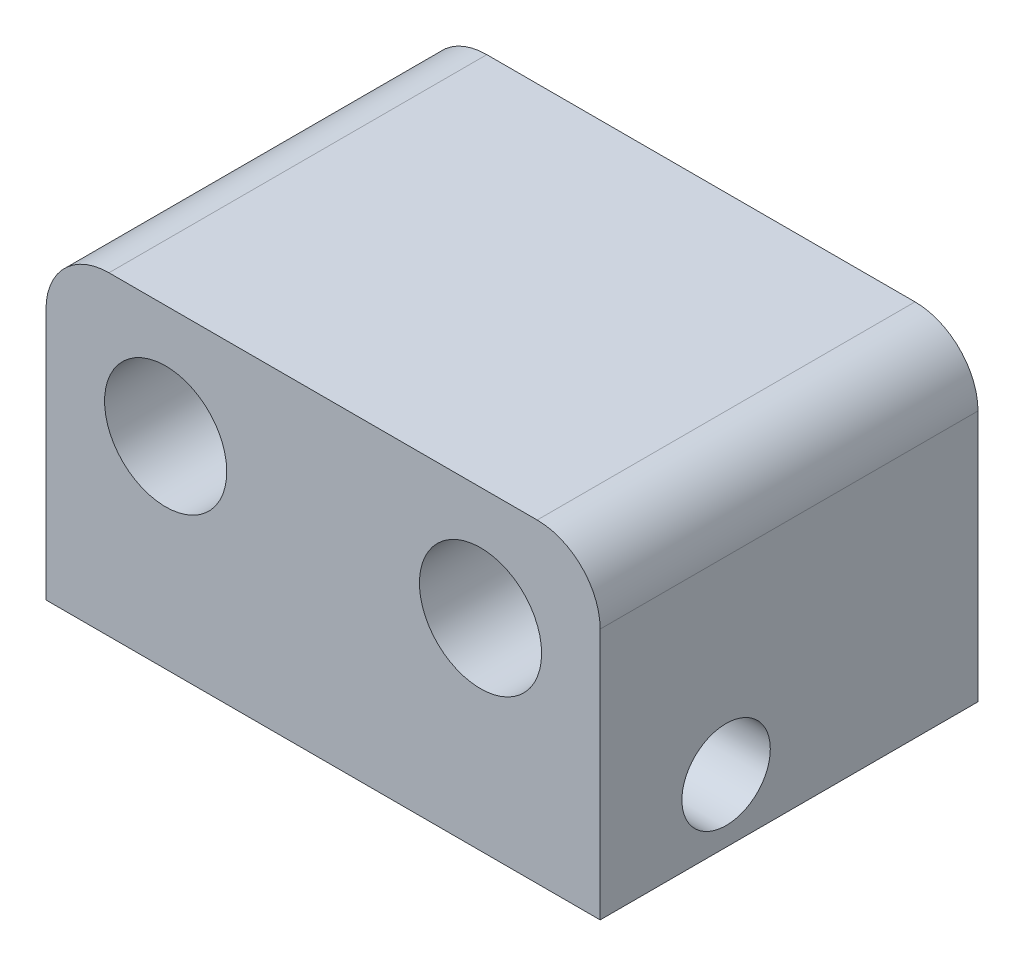
ISO-10303-21;
HEADER;
FILE_DESCRIPTION(('STEP AP214'),'2;1');
FILE_NAME('part.step','',(''),(''),'','','');
FILE_SCHEMA(('AUTOMOTIVE_DESIGN { 1 0 10303 214 1 1 1 1 }'));
ENDSEC;
DATA;
#1=APPLICATION_CONTEXT('core data for automotive mechanical design processes');
#2=APPLICATION_PROTOCOL_DEFINITION('international standard','automotive_design',2000,#1);
#3=PRODUCT_CONTEXT('',#1,'mechanical');
#4=PRODUCT('Part','Part','',(#3));
#5=PRODUCT_RELATED_PRODUCT_CATEGORY('part','',(#4));
#6=PRODUCT_DEFINITION_FORMATION('','',#4);
#7=PRODUCT_DEFINITION_CONTEXT('part definition',#1,'design');
#8=PRODUCT_DEFINITION('design','',#6,#7);
#9=PRODUCT_DEFINITION_SHAPE('','',#8);
#10=(LENGTH_UNIT() NAMED_UNIT(*) SI_UNIT(.MILLI.,.METRE.));
#11=(NAMED_UNIT(*) PLANE_ANGLE_UNIT() SI_UNIT($,.RADIAN.));
#12=(NAMED_UNIT(*) SI_UNIT($,.STERADIAN.) SOLID_ANGLE_UNIT());
#13=UNCERTAINTY_MEASURE_WITH_UNIT(LENGTH_MEASURE(1.E-05),#10,'distance_accuracy_value','');
#14=(GEOMETRIC_REPRESENTATION_CONTEXT(3) GLOBAL_UNCERTAINTY_ASSIGNED_CONTEXT((#13)) GLOBAL_UNIT_ASSIGNED_CONTEXT((#10,
#11,#12)) REPRESENTATION_CONTEXT('',''));
#15=CARTESIAN_POINT('',(0.,0.,0.));
#16=DIRECTION('',(0.,0.,1.));
#17=DIRECTION('',(1.,0.,0.));
#18=AXIS2_PLACEMENT_3D('',#15,#16,#17);
#19=CARTESIAN_POINT('',(-11.,0.,15.));
#20=DIRECTION('',(1.,0.,0.));
#21=DIRECTION('',(0.,0.,-1.));
#22=AXIS2_PLACEMENT_3D('',#19,#20,#21);
#23=PLANE('',#22);
#24=CARTESIAN_POINT('',(-11.,15.,10.));
#25=DIRECTION('',(1.,0.,0.));
#26=DIRECTION('',(0.,0.,-1.));
#27=AXIS2_PLACEMENT_3D('',#24,#25,#26);
#28=CIRCLE('',#27,1.755);
#29=CARTESIAN_POINT('',(-11.,15.,8.245));
#30=VERTEX_POINT('',#29);
#31=EDGE_CURVE('E161',#30,#30,#28,.T.);
#32=ORIENTED_EDGE('',*,*,#31,.T.);
#33=EDGE_LOOP('',(#32));
#34=FACE_BOUND('',#33,.T.);
#35=DIRECTION('',(0.,-1.,0.));
#36=VECTOR('',#35,1.);
#37=CARTESIAN_POINT('',(-11.,0.,15.));
#38=LINE('',#37,#36);
#39=CARTESIAN_POINT('',(-11.,22.5,15.));
#40=VERTEX_POINT('',#39);
#41=CARTESIAN_POINT('',(-11.,12.5,15.));
#42=VERTEX_POINT('',#41);
#43=EDGE_CURVE('E91',#40,#42,#38,.T.);
#44=ORIENTED_EDGE('',*,*,#43,.F.);
#45=DIRECTION('',(0.,0.,-1.));
#46=VECTOR('',#45,1.);
#47=CARTESIAN_POINT('',(-11.,22.5,0.));
#48=LINE('',#47,#46);
#49=CARTESIAN_POINT('',(-11.,22.5,0.));
#50=VERTEX_POINT('',#49);
#51=EDGE_CURVE('E115',#40,#50,#48,.T.);
#52=ORIENTED_EDGE('',*,*,#51,.T.);
#53=DIRECTION('',(0.,-1.,0.));
#54=VECTOR('',#53,1.);
#55=CARTESIAN_POINT('',(-11.,0.,0.));
#56=LINE('',#55,#54);
#57=CARTESIAN_POINT('',(-11.,12.5,0.));
#58=VERTEX_POINT('',#57);
#59=EDGE_CURVE('E113',#50,#58,#56,.T.);
#60=ORIENTED_EDGE('',*,*,#59,.T.);
#61=DIRECTION('',(0.,0.,-1.));
#62=VECTOR('',#61,1.);
#63=CARTESIAN_POINT('',(-11.,12.5,15.));
#64=LINE('',#63,#62);
#65=EDGE_CURVE('E107',#42,#58,#64,.T.);
#66=ORIENTED_EDGE('',*,*,#65,.F.);
#67=EDGE_LOOP('',(#44,#52,#60,#66));
#68=FACE_BOUND('',#67,.T.);
#69=ADVANCED_FACE('F39',(#34,#68),#23,.F.);
#70=CARTESIAN_POINT('',(0.,12.5,15.));
#71=DIRECTION('',(0.,1.,0.));
#72=DIRECTION('',(0.,0.,1.));
#73=AXIS2_PLACEMENT_3D('',#70,#71,#72);
#74=PLANE('',#73);
#75=DIRECTION('',(1.,0.,0.));
#76=VECTOR('',#75,1.);
#77=CARTESIAN_POINT('',(0.,12.5,0.));
#78=LINE('',#77,#76);
#79=CARTESIAN_POINT('',(11.,12.5,0.));
#80=VERTEX_POINT('',#79);
#81=EDGE_CURVE('E143',#58,#80,#78,.T.);
#82=ORIENTED_EDGE('',*,*,#81,.T.);
#83=DIRECTION('',(0.,0.,-1.));
#84=VECTOR('',#83,1.);
#85=CARTESIAN_POINT('',(11.,12.5,15.));
#86=LINE('',#85,#84);
#87=CARTESIAN_POINT('',(11.,12.5,15.));
#88=VERTEX_POINT('',#87);
#89=EDGE_CURVE('E109',#88,#80,#86,.T.);
#90=ORIENTED_EDGE('',*,*,#89,.F.);
#91=DIRECTION('',(1.,0.,0.));
#92=VECTOR('',#91,1.);
#93=CARTESIAN_POINT('',(0.,12.5,15.));
#94=LINE('',#93,#92);
#95=EDGE_CURVE('E94',#42,#88,#94,.T.);
#96=ORIENTED_EDGE('',*,*,#95,.F.);
#97=ORIENTED_EDGE('',*,*,#65,.T.);
#98=EDGE_LOOP('',(#82,#90,#96,#97));
#99=FACE_BOUND('',#98,.T.);
#100=ADVANCED_FACE('F106',(#99),#74,.F.);
#101=CARTESIAN_POINT('',(11.,0.,15.));
#102=DIRECTION('',(1.,0.,0.));
#103=DIRECTION('',(0.,0.,-1.));
#104=AXIS2_PLACEMENT_3D('',#101,#102,#103);
#105=PLANE('',#104);
#106=CARTESIAN_POINT('',(11.,15.,10.));
#107=DIRECTION('',(1.,0.,0.));
#108=DIRECTION('',(0.,0.,-1.));
#109=AXIS2_PLACEMENT_3D('',#106,#107,#108);
#110=CIRCLE('',#109,1.755);
#111=CARTESIAN_POINT('',(11.,15.,8.245));
#112=VERTEX_POINT('',#111);
#113=EDGE_CURVE('E168',#112,#112,#110,.T.);
#114=ORIENTED_EDGE('',*,*,#113,.F.);
#115=EDGE_LOOP('',(#114));
#116=FACE_BOUND('',#115,.T.);
#117=DIRECTION('',(0.,-1.,0.));
#118=VECTOR('',#117,1.);
#119=CARTESIAN_POINT('',(11.,0.,0.));
#120=LINE('',#119,#118);
#121=CARTESIAN_POINT('',(11.,22.5,0.));
#122=VERTEX_POINT('',#121);
#123=EDGE_CURVE('E146',#122,#80,#120,.T.);
#124=ORIENTED_EDGE('',*,*,#123,.F.);
#125=DIRECTION('',(0.,0.,-1.));
#126=VECTOR('',#125,1.);
#127=CARTESIAN_POINT('',(11.,22.5,15.));
#128=LINE('',#127,#126);
#129=CARTESIAN_POINT('',(11.,22.5,15.));
#130=VERTEX_POINT('',#129);
#131=EDGE_CURVE('E11',#122,#130,#128,.F.);
#132=ORIENTED_EDGE('',*,*,#131,.T.);
#133=DIRECTION('',(0.,-1.,0.));
#134=VECTOR('',#133,1.);
#135=CARTESIAN_POINT('',(11.,0.,15.));
#136=LINE('',#135,#134);
#137=EDGE_CURVE('E110',#130,#88,#136,.T.);
#138=ORIENTED_EDGE('',*,*,#137,.T.);
#139=ORIENTED_EDGE('',*,*,#89,.T.);
#140=EDGE_LOOP('',(#124,#132,#138,#139));
#141=FACE_BOUND('',#140,.T.);
#142=ADVANCED_FACE('F177',(#116,#141),#105,.T.);
#143=CARTESIAN_POINT('',(-6.25,20.5,15.));
#144=DIRECTION('',(0.,0.,-1.));
#145=DIRECTION('',(-1.,0.,0.));
#146=AXIS2_PLACEMENT_3D('',#143,#144,#145);
#147=CYLINDRICAL_SURFACE('',#146,2.425);
#148=CARTESIAN_POINT('',(-6.25,20.5,15.));
#149=DIRECTION('',(0.,0.,1.));
#150=DIRECTION('',(1.,0.,0.));
#151=AXIS2_PLACEMENT_3D('',#148,#149,#150);
#152=CIRCLE('',#151,2.425);
#153=CARTESIAN_POINT('',(-3.825,20.5,15.));
#154=VERTEX_POINT('',#153);
#155=EDGE_CURVE('E101',#154,#154,#152,.T.);
#156=ORIENTED_EDGE('',*,*,#155,.T.);
#157=EDGE_LOOP('',(#156));
#158=FACE_BOUND('',#157,.T.);
#159=CARTESIAN_POINT('',(-6.25,20.5,0.));
#160=DIRECTION('',(0.,0.,1.));
#161=DIRECTION('',(1.,0.,0.));
#162=AXIS2_PLACEMENT_3D('',#159,#160,#161);
#163=CIRCLE('',#162,2.425);
#164=CARTESIAN_POINT('',(-3.825,20.5,0.));
#165=VERTEX_POINT('',#164);
#166=EDGE_CURVE('E144',#165,#165,#163,.T.);
#167=ORIENTED_EDGE('',*,*,#166,.F.);
#168=EDGE_LOOP('',(#167));
#169=FACE_BOUND('',#168,.T.);
#170=ADVANCED_FACE('F179',(#158,#169),#147,.F.);
#171=CARTESIAN_POINT('',(6.25,20.5,15.));
#172=DIRECTION('',(0.,0.,-1.));
#173=DIRECTION('',(-1.,0.,0.));
#174=AXIS2_PLACEMENT_3D('',#171,#172,#173);
#175=CYLINDRICAL_SURFACE('',#174,2.425);
#176=CARTESIAN_POINT('',(6.25,20.5,15.));
#177=DIRECTION('',(0.,0.,1.));
#178=DIRECTION('',(1.,0.,0.));
#179=AXIS2_PLACEMENT_3D('',#176,#177,#178);
#180=CIRCLE('',#179,2.425);
#181=CARTESIAN_POINT('',(8.675,20.5,15.));
#182=VERTEX_POINT('',#181);
#183=EDGE_CURVE('E153',#182,#182,#180,.T.);
#184=ORIENTED_EDGE('',*,*,#183,.T.);
#185=EDGE_LOOP('',(#184));
#186=FACE_BOUND('',#185,.T.);
#187=CARTESIAN_POINT('',(6.25,20.5,0.));
#188=DIRECTION('',(0.,0.,1.));
#189=DIRECTION('',(1.,0.,0.));
#190=AXIS2_PLACEMENT_3D('',#187,#188,#189);
#191=CIRCLE('',#190,2.425);
#192=CARTESIAN_POINT('',(8.675,20.5,0.));
#193=VERTEX_POINT('',#192);
#194=EDGE_CURVE('E149',#193,#193,#191,.T.);
#195=ORIENTED_EDGE('',*,*,#194,.F.);
#196=EDGE_LOOP('',(#195));
#197=FACE_BOUND('',#196,.T.);
#198=ADVANCED_FACE('F195',(#186,#197),#175,.F.);
#199=CARTESIAN_POINT('',(0.,25.,15.));
#200=DIRECTION('',(0.,1.,0.));
#201=DIRECTION('',(0.,0.,1.));
#202=AXIS2_PLACEMENT_3D('',#199,#200,#201);
#203=PLANE('',#202);
#204=DIRECTION('',(1.,0.,0.));
#205=VECTOR('',#204,1.);
#206=CARTESIAN_POINT('',(0.,25.,0.));
#207=LINE('',#206,#205);
#208=CARTESIAN_POINT('',(-8.50000000000001,25.,0.));
#209=VERTEX_POINT('',#208);
#210=CARTESIAN_POINT('',(8.50000000000001,25.,0.));
#211=VERTEX_POINT('',#210);
#212=EDGE_CURVE('E137',#209,#211,#207,.T.);
#213=ORIENTED_EDGE('',*,*,#212,.F.);
#214=DIRECTION('',(0.,0.,-1.));
#215=VECTOR('',#214,1.);
#216=CARTESIAN_POINT('',(-8.50000000000001,25.,15.));
#217=LINE('',#216,#215);
#218=CARTESIAN_POINT('',(-8.50000000000001,25.,15.));
#219=VERTEX_POINT('',#218);
#220=EDGE_CURVE('E129',#209,#219,#217,.F.);
#221=ORIENTED_EDGE('',*,*,#220,.T.);
#222=DIRECTION('',(1.,0.,0.));
#223=VECTOR('',#222,1.);
#224=CARTESIAN_POINT('',(0.,25.,15.));
#225=LINE('',#224,#223);
#226=CARTESIAN_POINT('',(8.50000000000001,25.,15.));
#227=VERTEX_POINT('',#226);
#228=EDGE_CURVE('E119',#219,#227,#225,.T.);
#229=ORIENTED_EDGE('',*,*,#228,.T.);
#230=DIRECTION('',(0.,0.,-1.));
#231=VECTOR('',#230,1.);
#232=CARTESIAN_POINT('',(8.50000000000001,25.,15.));
#233=LINE('',#232,#231);
#234=EDGE_CURVE('E126',#227,#211,#233,.T.);
#235=ORIENTED_EDGE('',*,*,#234,.T.);
#236=EDGE_LOOP('',(#213,#221,#229,#235));
#237=FACE_BOUND('',#236,.T.);
#238=ADVANCED_FACE('F134',(#237),#203,.T.);
#239=CARTESIAN_POINT('',(0.,0.,15.));
#240=DIRECTION('',(0.,0.,1.));
#241=DIRECTION('',(1.,0.,0.));
#242=AXIS2_PLACEMENT_3D('',#239,#240,#241);
#243=PLANE('',#242);
#244=ORIENTED_EDGE('',*,*,#183,.F.);
#245=EDGE_LOOP('',(#244));
#246=FACE_BOUND('',#245,.T.);
#247=ORIENTED_EDGE('',*,*,#155,.F.);
#248=EDGE_LOOP('',(#247));
#249=FACE_BOUND('',#248,.T.);
#250=ORIENTED_EDGE('',*,*,#228,.F.);
#251=CARTESIAN_POINT('',(-8.50000000000001,22.5,15.));
#252=DIRECTION('',(0.,0.,1.));
#253=DIRECTION('',(1.,0.,0.));
#254=AXIS2_PLACEMENT_3D('',#251,#252,#253);
#255=CIRCLE('',#254,2.5);
#256=EDGE_CURVE('E47',#219,#40,#255,.T.);
#257=ORIENTED_EDGE('',*,*,#256,.T.);
#258=ORIENTED_EDGE('',*,*,#43,.T.);
#259=ORIENTED_EDGE('',*,*,#95,.T.);
#260=ORIENTED_EDGE('',*,*,#137,.F.);
#261=CARTESIAN_POINT('',(8.50000000000001,22.5,15.));
#262=DIRECTION('',(0.,0.,1.));
#263=DIRECTION('',(1.,0.,0.));
#264=AXIS2_PLACEMENT_3D('',#261,#262,#263);
#265=CIRCLE('',#264,2.5);
#266=EDGE_CURVE('E59',#130,#227,#265,.T.);
#267=ORIENTED_EDGE('',*,*,#266,.T.);
#268=EDGE_LOOP('',(#250,#257,#258,#259,#260,#267));
#269=FACE_BOUND('',#268,.T.);
#270=ADVANCED_FACE('F93',(#246,#249,#269),#243,.T.);
#271=CARTESIAN_POINT('',(0.,0.,0.));
#272=DIRECTION('',(0.,0.,1.));
#273=DIRECTION('',(1.,0.,0.));
#274=AXIS2_PLACEMENT_3D('',#271,#272,#273);
#275=PLANE('',#274);
#276=ORIENTED_EDGE('',*,*,#194,.T.);
#277=EDGE_LOOP('',(#276));
#278=FACE_BOUND('',#277,.T.);
#279=ORIENTED_EDGE('',*,*,#166,.T.);
#280=EDGE_LOOP('',(#279));
#281=FACE_BOUND('',#280,.T.);
#282=ORIENTED_EDGE('',*,*,#59,.F.);
#283=CARTESIAN_POINT('',(-8.50000000000001,22.5,0.));
#284=DIRECTION('',(0.,0.,1.));
#285=DIRECTION('',(1.,0.,0.));
#286=AXIS2_PLACEMENT_3D('',#283,#284,#285);
#287=CIRCLE('',#286,2.5);
#288=EDGE_CURVE('E124',#50,#209,#287,.F.);
#289=ORIENTED_EDGE('',*,*,#288,.T.);
#290=ORIENTED_EDGE('',*,*,#212,.T.);
#291=CARTESIAN_POINT('',(8.50000000000001,22.5,0.));
#292=DIRECTION('',(0.,0.,1.));
#293=DIRECTION('',(1.,0.,0.));
#294=AXIS2_PLACEMENT_3D('',#291,#292,#293);
#295=CIRCLE('',#294,2.5);
#296=EDGE_CURVE('E117',#211,#122,#295,.F.);
#297=ORIENTED_EDGE('',*,*,#296,.T.);
#298=ORIENTED_EDGE('',*,*,#123,.T.);
#299=ORIENTED_EDGE('',*,*,#81,.F.);
#300=EDGE_LOOP('',(#282,#289,#290,#297,#298,#299));
#301=FACE_BOUND('',#300,.T.);
#302=ADVANCED_FACE('F142',(#278,#281,#301),#275,.F.);
#303=CARTESIAN_POINT('',(-19.,15.,10.));
#304=DIRECTION('',(1.,0.,0.));
#305=DIRECTION('',(0.,0.,-1.));
#306=AXIS2_PLACEMENT_3D('',#303,#304,#305);
#307=CYLINDRICAL_SURFACE('',#306,1.755);
#308=ORIENTED_EDGE('',*,*,#113,.T.);
#309=EDGE_LOOP('',(#308));
#310=FACE_BOUND('',#309,.T.);
#311=ORIENTED_EDGE('',*,*,#31,.F.);
#312=EDGE_LOOP('',(#311));
#313=FACE_BOUND('',#312,.T.);
#314=ADVANCED_FACE('F174',(#310,#313),#307,.F.);
#315=CARTESIAN_POINT('',(-8.50000000000001,22.5,15.));
#316=DIRECTION('',(0.,0.,1.));
#317=DIRECTION('',(1.,0.,0.));
#318=AXIS2_PLACEMENT_3D('',#315,#316,#317);
#319=CYLINDRICAL_SURFACE('',#318,2.5);
#320=ORIENTED_EDGE('',*,*,#256,.F.);
#321=ORIENTED_EDGE('',*,*,#220,.F.);
#322=ORIENTED_EDGE('',*,*,#288,.F.);
#323=ORIENTED_EDGE('',*,*,#51,.F.);
#324=EDGE_LOOP('',(#320,#321,#322,#323));
#325=FACE_BOUND('',#324,.T.);
#326=ADVANCED_FACE('F140',(#325),#319,.T.);
#327=CARTESIAN_POINT('',(8.50000000000001,22.5,15.));
#328=DIRECTION('',(0.,0.,-1.));
#329=DIRECTION('',(-1.,0.,0.));
#330=AXIS2_PLACEMENT_3D('',#327,#328,#329);
#331=CYLINDRICAL_SURFACE('',#330,2.5);
#332=ORIENTED_EDGE('',*,*,#266,.F.);
#333=ORIENTED_EDGE('',*,*,#131,.F.);
#334=ORIENTED_EDGE('',*,*,#296,.F.);
#335=ORIENTED_EDGE('',*,*,#234,.F.);
#336=EDGE_LOOP('',(#332,#333,#334,#335));
#337=FACE_BOUND('',#336,.T.);
#338=ADVANCED_FACE('F41',(#337),#331,.T.);
#339=CLOSED_SHELL('',(#69,#100,#142,#170,#198,#238,#270,#302,#314,#326,#338));
#340=MANIFOLD_SOLID_BREP('B2',#339);
#341=ADVANCED_BREP_SHAPE_REPRESENTATION('',(#18,#340),#14);
#342=SHAPE_DEFINITION_REPRESENTATION(#9,#341);
ENDSEC;
END-ISO-10303-21;
